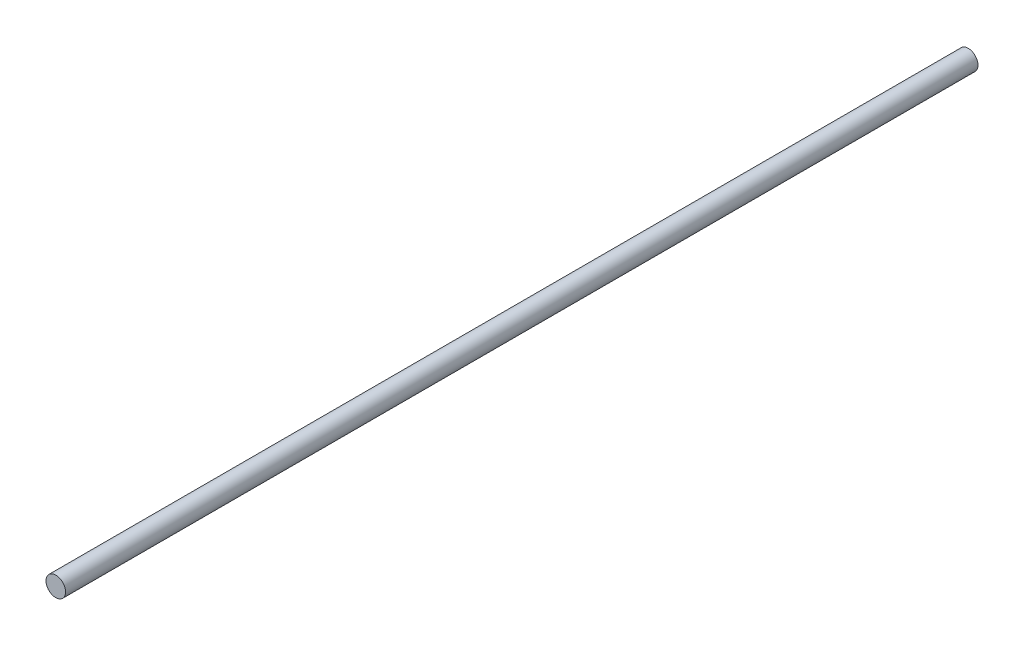
ISO-10303-21;
HEADER;
FILE_DESCRIPTION(('STEP AP214'),'2;1');
FILE_NAME('part.step','',(''),(''),'','','');
FILE_SCHEMA(('AUTOMOTIVE_DESIGN { 1 0 10303 214 1 1 1 1 }'));
ENDSEC;
DATA;
#1=APPLICATION_CONTEXT('core data for automotive mechanical design processes');
#2=APPLICATION_PROTOCOL_DEFINITION('international standard','automotive_design',2000,#1);
#3=PRODUCT_CONTEXT('',#1,'mechanical');
#4=PRODUCT('Part','Part','',(#3));
#5=PRODUCT_RELATED_PRODUCT_CATEGORY('part','',(#4));
#6=PRODUCT_DEFINITION_FORMATION('','',#4);
#7=PRODUCT_DEFINITION_CONTEXT('part definition',#1,'design');
#8=PRODUCT_DEFINITION('design','',#6,#7);
#9=PRODUCT_DEFINITION_SHAPE('','',#8);
#10=(LENGTH_UNIT() NAMED_UNIT(*) SI_UNIT(.MILLI.,.METRE.));
#11=(NAMED_UNIT(*) PLANE_ANGLE_UNIT() SI_UNIT($,.RADIAN.));
#12=(NAMED_UNIT(*) SI_UNIT($,.STERADIAN.) SOLID_ANGLE_UNIT());
#13=UNCERTAINTY_MEASURE_WITH_UNIT(LENGTH_MEASURE(1.E-05),#10,'distance_accuracy_value','');
#14=(GEOMETRIC_REPRESENTATION_CONTEXT(3) GLOBAL_UNCERTAINTY_ASSIGNED_CONTEXT((#13)) GLOBAL_UNIT_ASSIGNED_CONTEXT((#10,
#11,#12)) REPRESENTATION_CONTEXT('',''));
#15=CARTESIAN_POINT('',(0.,0.,0.));
#16=DIRECTION('',(0.,0.,1.));
#17=DIRECTION('',(1.,0.,0.));
#18=AXIS2_PLACEMENT_3D('',#15,#16,#17);
#19=CARTESIAN_POINT('',(0.,0.,280.));
#20=DIRECTION('',(0.,0.,-1.));
#21=DIRECTION('',(-1.,0.,0.));
#22=AXIS2_PLACEMENT_3D('',#19,#20,#21);
#23=CYLINDRICAL_SURFACE('',#22,3.);
#24=CARTESIAN_POINT('',(0.,0.,280.));
#25=DIRECTION('',(0.,0.,1.));
#26=DIRECTION('',(1.,0.,0.));
#27=AXIS2_PLACEMENT_3D('',#24,#25,#26);
#28=CIRCLE('',#27,3.);
#29=CARTESIAN_POINT('',(3.,0.,280.));
#30=VERTEX_POINT('',#29);
#31=EDGE_CURVE('E10',#30,#30,#28,.T.);
#32=ORIENTED_EDGE('',*,*,#31,.F.);
#33=EDGE_LOOP('',(#32));
#34=FACE_BOUND('',#33,.T.);
#35=CARTESIAN_POINT('',(0.,0.,0.));
#36=DIRECTION('',(0.,0.,1.));
#37=DIRECTION('',(1.,0.,0.));
#38=AXIS2_PLACEMENT_3D('',#35,#36,#37);
#39=CIRCLE('',#38,3.);
#40=CARTESIAN_POINT('',(3.,0.,0.));
#41=VERTEX_POINT('',#40);
#42=EDGE_CURVE('E40',#41,#41,#39,.T.);
#43=ORIENTED_EDGE('',*,*,#42,.T.);
#44=EDGE_LOOP('',(#43));
#45=FACE_BOUND('',#44,.T.);
#46=ADVANCED_FACE('F37',(#34,#45),#23,.T.);
#47=CARTESIAN_POINT('',(0.,0.,280.));
#48=DIRECTION('',(0.,0.,1.));
#49=DIRECTION('',(1.,0.,0.));
#50=AXIS2_PLACEMENT_3D('',#47,#48,#49);
#51=PLANE('',#50);
#52=ORIENTED_EDGE('',*,*,#31,.T.);
#53=EDGE_LOOP('',(#52));
#54=FACE_BOUND('',#53,.T.);
#55=ADVANCED_FACE('F54',(#54),#51,.T.);
#56=CARTESIAN_POINT('',(0.,0.,0.));
#57=DIRECTION('',(0.,0.,1.));
#58=DIRECTION('',(1.,0.,0.));
#59=AXIS2_PLACEMENT_3D('',#56,#57,#58);
#60=PLANE('',#59);
#61=ORIENTED_EDGE('',*,*,#42,.F.);
#62=EDGE_LOOP('',(#61));
#63=FACE_BOUND('',#62,.T.);
#64=ADVANCED_FACE('F52',(#63),#60,.F.);
#65=CLOSED_SHELL('',(#46,#55,#64));
#66=MANIFOLD_SOLID_BREP('B2',#65);
#67=ADVANCED_BREP_SHAPE_REPRESENTATION('',(#18,#66),#14);
#68=SHAPE_DEFINITION_REPRESENTATION(#9,#67);
ENDSEC;
END-ISO-10303-21;
